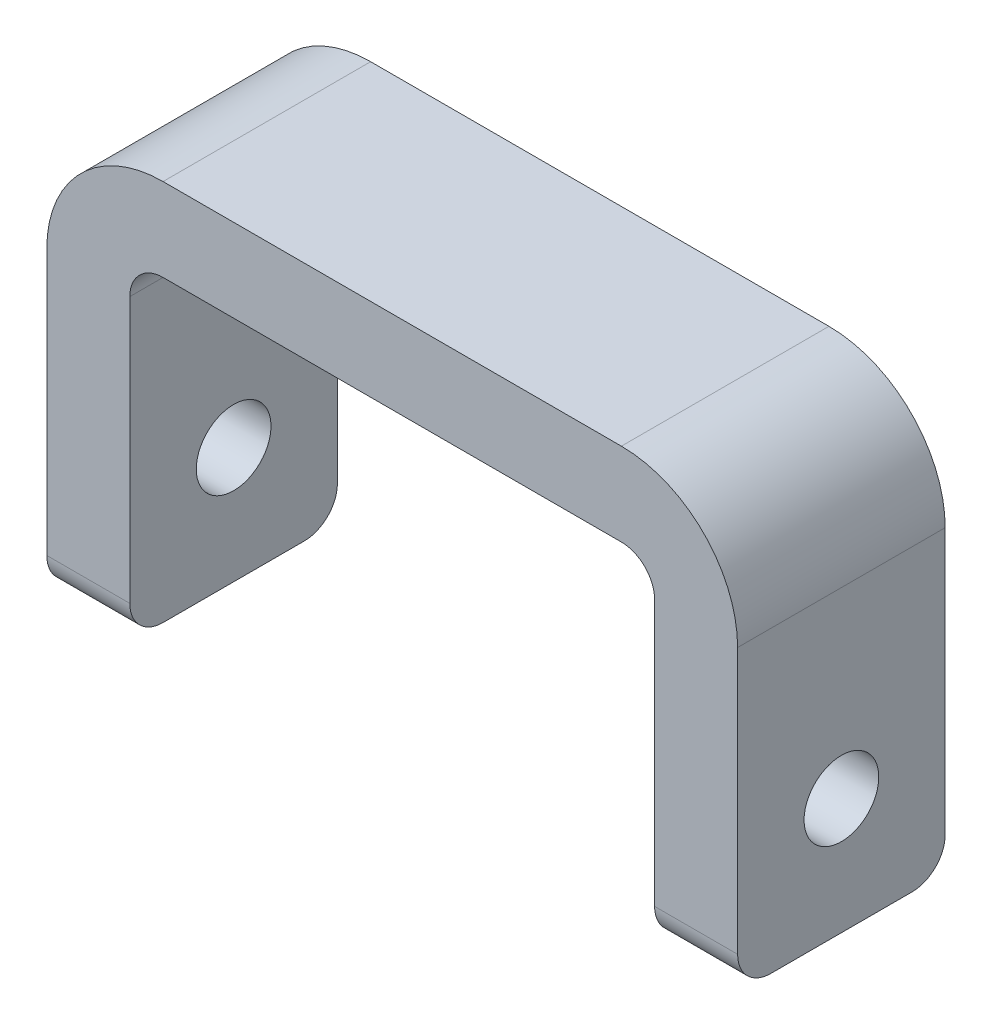
ISO-10303-21;
HEADER;
FILE_DESCRIPTION(('STEP AP214'),'2;1');
FILE_NAME('part.step','',(''),(''),'','','');
FILE_SCHEMA(('AUTOMOTIVE_DESIGN { 1 0 10303 214 1 1 1 1 }'));
ENDSEC;
DATA;
#1=APPLICATION_CONTEXT('core data for automotive mechanical design processes');
#2=APPLICATION_PROTOCOL_DEFINITION('international standard','automotive_design',2000,#1);
#3=PRODUCT_CONTEXT('',#1,'mechanical');
#4=PRODUCT('Part','Part','',(#3));
#5=PRODUCT_RELATED_PRODUCT_CATEGORY('part','',(#4));
#6=PRODUCT_DEFINITION_FORMATION('','',#4);
#7=PRODUCT_DEFINITION_CONTEXT('part definition',#1,'design');
#8=PRODUCT_DEFINITION('design','',#6,#7);
#9=PRODUCT_DEFINITION_SHAPE('','',#8);
#10=(LENGTH_UNIT() NAMED_UNIT(*) SI_UNIT(.MILLI.,.METRE.));
#11=(NAMED_UNIT(*) PLANE_ANGLE_UNIT() SI_UNIT($,.RADIAN.));
#12=(NAMED_UNIT(*) SI_UNIT($,.STERADIAN.) SOLID_ANGLE_UNIT());
#13=UNCERTAINTY_MEASURE_WITH_UNIT(LENGTH_MEASURE(1.E-05),#10,'distance_accuracy_value','');
#14=(GEOMETRIC_REPRESENTATION_CONTEXT(3) GLOBAL_UNCERTAINTY_ASSIGNED_CONTEXT((#13)) GLOBAL_UNIT_ASSIGNED_CONTEXT((#10,
#11,#12)) REPRESENTATION_CONTEXT('',''));
#15=CARTESIAN_POINT('',(0.,0.,0.));
#16=DIRECTION('',(0.,0.,1.));
#17=DIRECTION('',(1.,0.,0.));
#18=AXIS2_PLACEMENT_3D('',#15,#16,#17);
#19=CARTESIAN_POINT('',(-20.8,0.,6.25));
#20=DIRECTION('',(1.,0.,0.));
#21=DIRECTION('',(0.,0.,-1.));
#22=AXIS2_PLACEMENT_3D('',#19,#20,#21);
#23=PLANE('',#22);
#24=DIRECTION('',(0.,-1.,0.));
#25=VECTOR('',#24,1.);
#26=CARTESIAN_POINT('',(-20.8,0.,-6.25));
#27=LINE('',#26,#25);
#28=CARTESIAN_POINT('',(-20.8,18.,-6.25));
#29=VERTEX_POINT('',#28);
#30=CARTESIAN_POINT('',(-20.8,2.,-6.25));
#31=VERTEX_POINT('',#30);
#32=EDGE_CURVE('E206',#29,#31,#27,.T.);
#33=ORIENTED_EDGE('',*,*,#32,.T.);
#34=CARTESIAN_POINT('',(-20.8,2.,-4.25));
#35=DIRECTION('',(1.,0.,0.));
#36=DIRECTION('',(0.,0.,-1.));
#37=AXIS2_PLACEMENT_3D('',#34,#35,#36);
#38=CIRCLE('',#37,2.);
#39=CARTESIAN_POINT('',(-20.8,0.,-4.25));
#40=VERTEX_POINT('',#39);
#41=EDGE_CURVE('E11',#31,#40,#38,.F.);
#42=ORIENTED_EDGE('',*,*,#41,.T.);
#43=DIRECTION('',(0.,0.,-1.));
#44=VECTOR('',#43,1.);
#45=CARTESIAN_POINT('',(-20.8,0.,6.25));
#46=LINE('',#45,#44);
#47=CARTESIAN_POINT('',(-20.8,0.,4.25));
#48=VERTEX_POINT('',#47);
#49=EDGE_CURVE('E214',#48,#40,#46,.T.);
#50=ORIENTED_EDGE('',*,*,#49,.F.);
#51=CARTESIAN_POINT('',(-20.8,2.,4.25));
#52=DIRECTION('',(1.,0.,0.));
#53=DIRECTION('',(0.,0.,-1.));
#54=AXIS2_PLACEMENT_3D('',#51,#52,#53);
#55=CIRCLE('',#54,2.);
#56=CARTESIAN_POINT('',(-20.8,2.,6.25));
#57=VERTEX_POINT('',#56);
#58=EDGE_CURVE('E54',#48,#57,#55,.F.);
#59=ORIENTED_EDGE('',*,*,#58,.T.);
#60=DIRECTION('',(0.,-1.,0.));
#61=VECTOR('',#60,1.);
#62=CARTESIAN_POINT('',(-20.8,0.,6.25));
#63=LINE('',#62,#61);
#64=CARTESIAN_POINT('',(-20.8,18.,6.25));
#65=VERTEX_POINT('',#64);
#66=EDGE_CURVE('E215',#65,#57,#63,.T.);
#67=ORIENTED_EDGE('',*,*,#66,.F.);
#68=DIRECTION('',(0.,0.,-1.));
#69=VECTOR('',#68,1.);
#70=CARTESIAN_POINT('',(-20.8,18.,6.25));
#71=LINE('',#70,#69);
#72=EDGE_CURVE('E265',#65,#29,#71,.T.);
#73=ORIENTED_EDGE('',*,*,#72,.T.);
#74=EDGE_LOOP('',(#33,#42,#50,#59,#67,#73));
#75=FACE_BOUND('',#74,.T.);
#76=CARTESIAN_POINT('',(-20.8,7.,0.));
#77=DIRECTION('',(-1.,0.,0.));
#78=DIRECTION('',(0.,0.,1.));
#79=AXIS2_PLACEMENT_3D('',#76,#77,#78);
#80=CIRCLE('',#79,2.24999999999999);
#81=CARTESIAN_POINT('',(-20.8,7.,2.24999999999999));
#82=VERTEX_POINT('',#81);
#83=EDGE_CURVE('E364',#82,#82,#80,.T.);
#84=ORIENTED_EDGE('',*,*,#83,.F.);
#85=EDGE_LOOP('',(#84));
#86=FACE_BOUND('',#85,.T.);
#87=ADVANCED_FACE('F45',(#75,#86),#23,.F.);
#88=CARTESIAN_POINT('',(-15.8,0.,6.25));
#89=DIRECTION('',(-1.,0.,0.));
#90=DIRECTION('',(0.,0.,1.));
#91=AXIS2_PLACEMENT_3D('',#88,#89,#90);
#92=PLANE('',#91);
#93=CARTESIAN_POINT('',(-15.8,7.,0.));
#94=DIRECTION('',(-1.,0.,0.));
#95=DIRECTION('',(0.,0.,1.));
#96=AXIS2_PLACEMENT_3D('',#93,#94,#95);
#97=CIRCLE('',#96,2.24999999999999);
#98=CARTESIAN_POINT('',(-15.8,7.,2.24999999999999));
#99=VERTEX_POINT('',#98);
#100=EDGE_CURVE('E340',#99,#99,#97,.T.);
#101=ORIENTED_EDGE('',*,*,#100,.T.);
#102=EDGE_LOOP('',(#101));
#103=FACE_BOUND('',#102,.T.);
#104=DIRECTION('',(0.,0.,-1.));
#105=VECTOR('',#104,1.);
#106=CARTESIAN_POINT('',(-15.8,0.,6.25));
#107=LINE('',#106,#105);
#108=CARTESIAN_POINT('',(-15.8,0.,4.25));
#109=VERTEX_POINT('',#108);
#110=CARTESIAN_POINT('',(-15.8,0.,-4.25));
#111=VERTEX_POINT('',#110);
#112=EDGE_CURVE('E210',#109,#111,#107,.T.);
#113=ORIENTED_EDGE('',*,*,#112,.T.);
#114=CARTESIAN_POINT('',(-15.8,2.,-4.25));
#115=DIRECTION('',(-1.,0.,0.));
#116=DIRECTION('',(0.,0.,1.));
#117=AXIS2_PLACEMENT_3D('',#114,#115,#116);
#118=CIRCLE('',#117,2.);
#119=CARTESIAN_POINT('',(-15.8,2.,-6.25));
#120=VERTEX_POINT('',#119);
#121=EDGE_CURVE('E310',#111,#120,#118,.F.);
#122=ORIENTED_EDGE('',*,*,#121,.T.);
#123=DIRECTION('',(0.,1.,0.));
#124=VECTOR('',#123,1.);
#125=CARTESIAN_POINT('',(-15.8,0.,-6.25));
#126=LINE('',#125,#124);
#127=CARTESIAN_POINT('',(-15.8,18.,-6.25));
#128=VERTEX_POINT('',#127);
#129=EDGE_CURVE('E199',#120,#128,#126,.T.);
#130=ORIENTED_EDGE('',*,*,#129,.T.);
#131=DIRECTION('',(0.,0.,-1.));
#132=VECTOR('',#131,1.);
#133=CARTESIAN_POINT('',(-15.8,18.,6.25));
#134=LINE('',#133,#132);
#135=CARTESIAN_POINT('',(-15.8,18.,6.25));
#136=VERTEX_POINT('',#135);
#137=EDGE_CURVE('E171',#128,#136,#134,.F.);
#138=ORIENTED_EDGE('',*,*,#137,.T.);
#139=DIRECTION('',(0.,1.,0.));
#140=VECTOR('',#139,1.);
#141=CARTESIAN_POINT('',(-15.8,0.,6.25));
#142=LINE('',#141,#140);
#143=CARTESIAN_POINT('',(-15.8,2.,6.25));
#144=VERTEX_POINT('',#143);
#145=EDGE_CURVE('E209',#144,#136,#142,.T.);
#146=ORIENTED_EDGE('',*,*,#145,.F.);
#147=CARTESIAN_POINT('',(-15.8,2.,4.25));
#148=DIRECTION('',(-1.,0.,0.));
#149=DIRECTION('',(0.,0.,1.));
#150=AXIS2_PLACEMENT_3D('',#147,#148,#149);
#151=CIRCLE('',#150,2.);
#152=EDGE_CURVE('E307',#144,#109,#151,.F.);
#153=ORIENTED_EDGE('',*,*,#152,.T.);
#154=EDGE_LOOP('',(#113,#122,#130,#138,#146,#153));
#155=FACE_BOUND('',#154,.T.);
#156=ADVANCED_FACE('F330',(#103,#155),#92,.F.);
#157=CARTESIAN_POINT('',(-15.8,20.,6.25));
#158=DIRECTION('',(0.,1.,0.));
#159=DIRECTION('',(0.,0.,1.));
#160=AXIS2_PLACEMENT_3D('',#157,#158,#159);
#161=PLANE('',#160);
#162=DIRECTION('',(1.,0.,0.));
#163=VECTOR('',#162,1.);
#164=CARTESIAN_POINT('',(-15.8,20.,-6.25));
#165=LINE('',#164,#163);
#166=CARTESIAN_POINT('',(-13.8,20.,-6.25));
#167=VERTEX_POINT('',#166);
#168=CARTESIAN_POINT('',(13.8,20.,-6.25));
#169=VERTEX_POINT('',#168);
#170=EDGE_CURVE('E191',#167,#169,#165,.T.);
#171=ORIENTED_EDGE('',*,*,#170,.T.);
#172=DIRECTION('',(0.,0.,-1.));
#173=VECTOR('',#172,1.);
#174=CARTESIAN_POINT('',(13.8,20.,6.25));
#175=LINE('',#174,#173);
#176=CARTESIAN_POINT('',(13.8,20.,6.25));
#177=VERTEX_POINT('',#176);
#178=EDGE_CURVE('E164',#169,#177,#175,.F.);
#179=ORIENTED_EDGE('',*,*,#178,.T.);
#180=DIRECTION('',(1.,0.,0.));
#181=VECTOR('',#180,1.);
#182=CARTESIAN_POINT('',(-15.8,20.,6.25));
#183=LINE('',#182,#181);
#184=CARTESIAN_POINT('',(-13.8,20.,6.25));
#185=VERTEX_POINT('',#184);
#186=EDGE_CURVE('E353',#185,#177,#183,.T.);
#187=ORIENTED_EDGE('',*,*,#186,.F.);
#188=DIRECTION('',(0.,0.,-1.));
#189=VECTOR('',#188,1.);
#190=CARTESIAN_POINT('',(-13.8,20.,-6.25));
#191=LINE('',#190,#189);
#192=EDGE_CURVE('E182',#185,#167,#191,.T.);
#193=ORIENTED_EDGE('',*,*,#192,.T.);
#194=EDGE_LOOP('',(#171,#179,#187,#193));
#195=FACE_BOUND('',#194,.T.);
#196=ADVANCED_FACE('F375',(#195),#161,.F.);
#197=CARTESIAN_POINT('',(15.8,0.,6.25));
#198=DIRECTION('',(1.,0.,0.));
#199=DIRECTION('',(0.,0.,-1.));
#200=AXIS2_PLACEMENT_3D('',#197,#198,#199);
#201=PLANE('',#200);
#202=CARTESIAN_POINT('',(15.8,7.,0.));
#203=DIRECTION('',(1.,0.,0.));
#204=DIRECTION('',(0.,0.,-1.));
#205=AXIS2_PLACEMENT_3D('',#202,#203,#204);
#206=CIRCLE('',#205,2.24999999999999);
#207=CARTESIAN_POINT('',(15.8,7.,-2.24999999999999));
#208=VERTEX_POINT('',#207);
#209=EDGE_CURVE('E343',#208,#208,#206,.T.);
#210=ORIENTED_EDGE('',*,*,#209,.T.);
#211=EDGE_LOOP('',(#210));
#212=FACE_BOUND('',#211,.T.);
#213=DIRECTION('',(0.,-1.,0.));
#214=VECTOR('',#213,1.);
#215=CARTESIAN_POINT('',(15.8,0.,-6.25));
#216=LINE('',#215,#214);
#217=CARTESIAN_POINT('',(15.8,18.,-6.25));
#218=VERTEX_POINT('',#217);
#219=CARTESIAN_POINT('',(15.8,2.,-6.25));
#220=VERTEX_POINT('',#219);
#221=EDGE_CURVE('E177',#218,#220,#216,.T.);
#222=ORIENTED_EDGE('',*,*,#221,.T.);
#223=CARTESIAN_POINT('',(15.8,2.,-4.25));
#224=DIRECTION('',(1.,0.,0.));
#225=DIRECTION('',(0.,0.,-1.));
#226=AXIS2_PLACEMENT_3D('',#223,#224,#225);
#227=CIRCLE('',#226,2.);
#228=CARTESIAN_POINT('',(15.8,0.,-4.25));
#229=VERTEX_POINT('',#228);
#230=EDGE_CURVE('E290',#220,#229,#227,.F.);
#231=ORIENTED_EDGE('',*,*,#230,.T.);
#232=DIRECTION('',(0.,0.,-1.));
#233=VECTOR('',#232,1.);
#234=CARTESIAN_POINT('',(15.8,0.,6.25));
#235=LINE('',#234,#233);
#236=CARTESIAN_POINT('',(15.8,0.,4.25));
#237=VERTEX_POINT('',#236);
#238=EDGE_CURVE('E183',#237,#229,#235,.T.);
#239=ORIENTED_EDGE('',*,*,#238,.F.);
#240=CARTESIAN_POINT('',(15.8,2.,4.25));
#241=DIRECTION('',(1.,0.,0.));
#242=DIRECTION('',(0.,0.,-1.));
#243=AXIS2_PLACEMENT_3D('',#240,#241,#242);
#244=CIRCLE('',#243,2.);
#245=CARTESIAN_POINT('',(15.8,2.,6.25));
#246=VERTEX_POINT('',#245);
#247=EDGE_CURVE('E287',#237,#246,#244,.F.);
#248=ORIENTED_EDGE('',*,*,#247,.T.);
#249=DIRECTION('',(0.,-1.,0.));
#250=VECTOR('',#249,1.);
#251=CARTESIAN_POINT('',(15.8,0.,6.25));
#252=LINE('',#251,#250);
#253=CARTESIAN_POINT('',(15.8,18.,6.25));
#254=VERTEX_POINT('',#253);
#255=EDGE_CURVE('E180',#254,#246,#252,.T.);
#256=ORIENTED_EDGE('',*,*,#255,.F.);
#257=DIRECTION('',(0.,0.,-1.));
#258=VECTOR('',#257,1.);
#259=CARTESIAN_POINT('',(15.8,18.,-6.25));
#260=LINE('',#259,#258);
#261=EDGE_CURVE('E163',#254,#218,#260,.T.);
#262=ORIENTED_EDGE('',*,*,#261,.T.);
#263=EDGE_LOOP('',(#222,#231,#239,#248,#256,#262));
#264=FACE_BOUND('',#263,.T.);
#265=ADVANCED_FACE('F176',(#212,#264),#201,.F.);
#266=CARTESIAN_POINT('',(15.8,0.,6.25));
#267=DIRECTION('',(0.,1.,0.));
#268=DIRECTION('',(-1.,0.,0.));
#269=AXIS2_PLACEMENT_3D('',#266,#267,#268);
#270=PLANE('',#269);
#271=ORIENTED_EDGE('',*,*,#238,.T.);
#272=DIRECTION('',(1.,0.,0.));
#273=VECTOR('',#272,1.);
#274=CARTESIAN_POINT('',(20.8,0.,-4.25));
#275=LINE('',#274,#273);
#276=CARTESIAN_POINT('',(20.8,0.,-4.25));
#277=VERTEX_POINT('',#276);
#278=EDGE_CURVE('E272',#229,#277,#275,.T.);
#279=ORIENTED_EDGE('',*,*,#278,.T.);
#280=DIRECTION('',(0.,0.,-1.));
#281=VECTOR('',#280,1.);
#282=CARTESIAN_POINT('',(20.8,0.,6.25));
#283=LINE('',#282,#281);
#284=CARTESIAN_POINT('',(20.8,0.,4.25));
#285=VERTEX_POINT('',#284);
#286=EDGE_CURVE('E218',#285,#277,#283,.T.);
#287=ORIENTED_EDGE('',*,*,#286,.F.);
#288=DIRECTION('',(1.,0.,0.));
#289=VECTOR('',#288,1.);
#290=CARTESIAN_POINT('',(15.8,0.,4.25));
#291=LINE('',#290,#289);
#292=EDGE_CURVE('E269',#285,#237,#291,.F.);
#293=ORIENTED_EDGE('',*,*,#292,.T.);
#294=EDGE_LOOP('',(#271,#279,#287,#293));
#295=FACE_BOUND('',#294,.T.);
#296=ADVANCED_FACE('F388',(#295),#270,.F.);
#297=CARTESIAN_POINT('',(20.8,0.,6.25));
#298=DIRECTION('',(-1.,0.,0.));
#299=DIRECTION('',(0.,0.,1.));
#300=AXIS2_PLACEMENT_3D('',#297,#298,#299);
#301=PLANE('',#300);
#302=CARTESIAN_POINT('',(20.8,7.,0.));
#303=DIRECTION('',(-1.,0.,0.));
#304=DIRECTION('',(0.,0.,1.));
#305=AXIS2_PLACEMENT_3D('',#302,#303,#304);
#306=CIRCLE('',#305,2.24999999999999);
#307=CARTESIAN_POINT('',(20.8,7.,2.24999999999999));
#308=VERTEX_POINT('',#307);
#309=EDGE_CURVE('E360',#308,#308,#306,.T.);
#310=ORIENTED_EDGE('',*,*,#309,.T.);
#311=EDGE_LOOP('',(#310));
#312=FACE_BOUND('',#311,.T.);
#313=ORIENTED_EDGE('',*,*,#286,.T.);
#314=CARTESIAN_POINT('',(20.8,2.,-4.25));
#315=DIRECTION('',(-1.,0.,0.));
#316=DIRECTION('',(0.,0.,1.));
#317=AXIS2_PLACEMENT_3D('',#314,#315,#316);
#318=CIRCLE('',#317,2.);
#319=CARTESIAN_POINT('',(20.8,2.,-6.25));
#320=VERTEX_POINT('',#319);
#321=EDGE_CURVE('E279',#277,#320,#318,.F.);
#322=ORIENTED_EDGE('',*,*,#321,.T.);
#323=DIRECTION('',(0.,1.,0.));
#324=VECTOR('',#323,1.);
#325=CARTESIAN_POINT('',(20.8,0.,-6.25));
#326=LINE('',#325,#324);
#327=CARTESIAN_POINT('',(20.8,18.,-6.25));
#328=VERTEX_POINT('',#327);
#329=EDGE_CURVE('E190',#320,#328,#326,.T.);
#330=ORIENTED_EDGE('',*,*,#329,.T.);
#331=DIRECTION('',(0.,0.,-1.));
#332=VECTOR('',#331,1.);
#333=CARTESIAN_POINT('',(20.8,18.,6.25));
#334=LINE('',#333,#332);
#335=CARTESIAN_POINT('',(20.8,18.,6.25));
#336=VERTEX_POINT('',#335);
#337=EDGE_CURVE('E255',#328,#336,#334,.F.);
#338=ORIENTED_EDGE('',*,*,#337,.T.);
#339=DIRECTION('',(0.,1.,0.));
#340=VECTOR('',#339,1.);
#341=CARTESIAN_POINT('',(20.8,0.,6.25));
#342=LINE('',#341,#340);
#343=CARTESIAN_POINT('',(20.8,2.,6.25));
#344=VERTEX_POINT('',#343);
#345=EDGE_CURVE('E348',#344,#336,#342,.T.);
#346=ORIENTED_EDGE('',*,*,#345,.F.);
#347=CARTESIAN_POINT('',(20.8,2.,4.25));
#348=DIRECTION('',(-1.,0.,0.));
#349=DIRECTION('',(0.,0.,1.));
#350=AXIS2_PLACEMENT_3D('',#347,#348,#349);
#351=CIRCLE('',#350,2.);
#352=EDGE_CURVE('E276',#344,#285,#351,.F.);
#353=ORIENTED_EDGE('',*,*,#352,.T.);
#354=EDGE_LOOP('',(#313,#322,#330,#338,#346,#353));
#355=FACE_BOUND('',#354,.T.);
#356=ADVANCED_FACE('F384',(#312,#355),#301,.F.);
#357=CARTESIAN_POINT('',(-20.8,25.,6.25));
#358=DIRECTION('',(0.,-1.,0.));
#359=DIRECTION('',(0.,0.,-1.));
#360=AXIS2_PLACEMENT_3D('',#357,#358,#359);
#361=PLANE('',#360);
#362=DIRECTION('',(-1.,0.,0.));
#363=VECTOR('',#362,1.);
#364=CARTESIAN_POINT('',(-20.8,25.,6.25));
#365=LINE('',#364,#363);
#366=CARTESIAN_POINT('',(13.8,25.,6.25));
#367=VERTEX_POINT('',#366);
#368=CARTESIAN_POINT('',(-13.8,25.,6.25));
#369=VERTEX_POINT('',#368);
#370=EDGE_CURVE('E327',#367,#369,#365,.T.);
#371=ORIENTED_EDGE('',*,*,#370,.F.);
#372=DIRECTION('',(0.,0.,-1.));
#373=VECTOR('',#372,1.);
#374=CARTESIAN_POINT('',(13.8,25.,6.25));
#375=LINE('',#374,#373);
#376=CARTESIAN_POINT('',(13.8,25.,-6.25));
#377=VERTEX_POINT('',#376);
#378=EDGE_CURVE('E244',#367,#377,#375,.T.);
#379=ORIENTED_EDGE('',*,*,#378,.T.);
#380=DIRECTION('',(-1.,0.,0.));
#381=VECTOR('',#380,1.);
#382=CARTESIAN_POINT('',(-20.8,25.,-6.25));
#383=LINE('',#382,#381);
#384=CARTESIAN_POINT('',(-13.8,25.,-6.25));
#385=VERTEX_POINT('',#384);
#386=EDGE_CURVE('E196',#377,#385,#383,.T.);
#387=ORIENTED_EDGE('',*,*,#386,.T.);
#388=DIRECTION('',(0.,0.,-1.));
#389=VECTOR('',#388,1.);
#390=CARTESIAN_POINT('',(-13.8,25.,6.25));
#391=LINE('',#390,#389);
#392=EDGE_CURVE('E242',#385,#369,#391,.F.);
#393=ORIENTED_EDGE('',*,*,#392,.T.);
#394=EDGE_LOOP('',(#371,#379,#387,#393));
#395=FACE_BOUND('',#394,.T.);
#396=ADVANCED_FACE('F381',(#395),#361,.F.);
#397=CARTESIAN_POINT('',(-15.8,0.,6.25));
#398=DIRECTION('',(0.,1.,0.));
#399=DIRECTION('',(-1.,0.,0.));
#400=AXIS2_PLACEMENT_3D('',#397,#398,#399);
#401=PLANE('',#400);
#402=ORIENTED_EDGE('',*,*,#49,.T.);
#403=DIRECTION('',(1.,0.,0.));
#404=VECTOR('',#403,1.);
#405=CARTESIAN_POINT('',(-15.8,0.,-4.25));
#406=LINE('',#405,#404);
#407=EDGE_CURVE('E303',#40,#111,#406,.T.);
#408=ORIENTED_EDGE('',*,*,#407,.T.);
#409=ORIENTED_EDGE('',*,*,#112,.F.);
#410=DIRECTION('',(1.,0.,0.));
#411=VECTOR('',#410,1.);
#412=CARTESIAN_POINT('',(-15.8,0.,4.25));
#413=LINE('',#412,#411);
#414=EDGE_CURVE('E66',#109,#48,#413,.F.);
#415=ORIENTED_EDGE('',*,*,#414,.T.);
#416=EDGE_LOOP('',(#402,#408,#409,#415));
#417=FACE_BOUND('',#416,.T.);
#418=ADVANCED_FACE('F331',(#417),#401,.F.);
#419=CARTESIAN_POINT('',(0.,0.,6.25));
#420=DIRECTION('',(0.,0.,-1.));
#421=DIRECTION('',(-1.,0.,0.));
#422=AXIS2_PLACEMENT_3D('',#419,#420,#421);
#423=PLANE('',#422);
#424=ORIENTED_EDGE('',*,*,#255,.T.);
#425=DIRECTION('',(1.,0.,0.));
#426=VECTOR('',#425,1.);
#427=CARTESIAN_POINT('',(0.,2.,6.25));
#428=LINE('',#427,#426);
#429=EDGE_CURVE('E297',#246,#344,#428,.T.);
#430=ORIENTED_EDGE('',*,*,#429,.T.);
#431=ORIENTED_EDGE('',*,*,#345,.T.);
#432=CARTESIAN_POINT('',(13.8,18.,6.25));
#433=DIRECTION('',(0.,0.,-1.));
#434=DIRECTION('',(-1.,0.,0.));
#435=AXIS2_PLACEMENT_3D('',#432,#433,#434);
#436=CIRCLE('',#435,7.);
#437=EDGE_CURVE('E262',#336,#367,#436,.F.);
#438=ORIENTED_EDGE('',*,*,#437,.T.);
#439=ORIENTED_EDGE('',*,*,#370,.T.);
#440=CARTESIAN_POINT('',(-13.8,18.,6.25));
#441=DIRECTION('',(0.,0.,-1.));
#442=DIRECTION('',(-1.,0.,0.));
#443=AXIS2_PLACEMENT_3D('',#440,#441,#442);
#444=CIRCLE('',#443,7.);
#445=EDGE_CURVE('E259',#369,#65,#444,.F.);
#446=ORIENTED_EDGE('',*,*,#445,.T.);
#447=ORIENTED_EDGE('',*,*,#66,.T.);
#448=DIRECTION('',(1.,0.,0.));
#449=VECTOR('',#448,1.);
#450=CARTESIAN_POINT('',(0.,2.,6.25));
#451=LINE('',#450,#449);
#452=EDGE_CURVE('E293',#57,#144,#451,.T.);
#453=ORIENTED_EDGE('',*,*,#452,.T.);
#454=ORIENTED_EDGE('',*,*,#145,.T.);
#455=CARTESIAN_POINT('',(-13.8,18.,6.25));
#456=DIRECTION('',(0.,0.,-1.));
#457=DIRECTION('',(-1.,0.,0.));
#458=AXIS2_PLACEMENT_3D('',#455,#456,#457);
#459=CIRCLE('',#458,2.);
#460=EDGE_CURVE('E239',#136,#185,#459,.T.);
#461=ORIENTED_EDGE('',*,*,#460,.T.);
#462=ORIENTED_EDGE('',*,*,#186,.T.);
#463=CARTESIAN_POINT('',(13.8,18.,6.25));
#464=DIRECTION('',(0.,0.,-1.));
#465=DIRECTION('',(-1.,0.,0.));
#466=AXIS2_PLACEMENT_3D('',#463,#464,#465);
#467=CIRCLE('',#466,2.);
#468=EDGE_CURVE('E170',#177,#254,#467,.T.);
#469=ORIENTED_EDGE('',*,*,#468,.T.);
#470=EDGE_LOOP('',(#424,#430,#431,#438,#439,#446,#447,#453,#454,#461,#462,#469));
#471=FACE_BOUND('',#470,.T.);
#472=ADVANCED_FACE('F322',(#471),#423,.F.);
#473=CARTESIAN_POINT('',(0.,0.,-6.25));
#474=DIRECTION('',(0.,0.,-1.));
#475=DIRECTION('',(-1.,0.,0.));
#476=AXIS2_PLACEMENT_3D('',#473,#474,#475);
#477=PLANE('',#476);
#478=ORIENTED_EDGE('',*,*,#329,.F.);
#479=DIRECTION('',(1.,0.,0.));
#480=VECTOR('',#479,1.);
#481=CARTESIAN_POINT('',(15.8,2.,-6.25));
#482=LINE('',#481,#480);
#483=EDGE_CURVE('E188',#320,#220,#482,.F.);
#484=ORIENTED_EDGE('',*,*,#483,.T.);
#485=ORIENTED_EDGE('',*,*,#221,.F.);
#486=CARTESIAN_POINT('',(13.8,18.,-6.25));
#487=DIRECTION('',(0.,0.,-1.));
#488=DIRECTION('',(-1.,0.,0.));
#489=AXIS2_PLACEMENT_3D('',#486,#487,#488);
#490=CIRCLE('',#489,2.);
#491=EDGE_CURVE('E159',#218,#169,#490,.F.);
#492=ORIENTED_EDGE('',*,*,#491,.T.);
#493=ORIENTED_EDGE('',*,*,#170,.F.);
#494=CARTESIAN_POINT('',(-13.8,18.,-6.25));
#495=DIRECTION('',(0.,0.,-1.));
#496=DIRECTION('',(-1.,0.,0.));
#497=AXIS2_PLACEMENT_3D('',#494,#495,#496);
#498=CIRCLE('',#497,2.);
#499=EDGE_CURVE('E235',#167,#128,#498,.F.);
#500=ORIENTED_EDGE('',*,*,#499,.T.);
#501=ORIENTED_EDGE('',*,*,#129,.F.);
#502=DIRECTION('',(1.,0.,0.));
#503=VECTOR('',#502,1.);
#504=CARTESIAN_POINT('',(-20.8,2.,-6.25));
#505=LINE('',#504,#503);
#506=EDGE_CURVE('E282',#120,#31,#505,.F.);
#507=ORIENTED_EDGE('',*,*,#506,.T.);
#508=ORIENTED_EDGE('',*,*,#32,.F.);
#509=CARTESIAN_POINT('',(-13.8,18.,-6.25));
#510=DIRECTION('',(0.,0.,-1.));
#511=DIRECTION('',(-1.,0.,0.));
#512=AXIS2_PLACEMENT_3D('',#509,#510,#511);
#513=CIRCLE('',#512,7.);
#514=EDGE_CURVE('E248',#29,#385,#513,.T.);
#515=ORIENTED_EDGE('',*,*,#514,.T.);
#516=ORIENTED_EDGE('',*,*,#386,.F.);
#517=CARTESIAN_POINT('',(13.8,18.,-6.25));
#518=DIRECTION('',(0.,0.,-1.));
#519=DIRECTION('',(-1.,0.,0.));
#520=AXIS2_PLACEMENT_3D('',#517,#518,#519);
#521=CIRCLE('',#520,7.);
#522=EDGE_CURVE('E251',#377,#328,#521,.T.);
#523=ORIENTED_EDGE('',*,*,#522,.T.);
#524=EDGE_LOOP('',(#478,#484,#485,#492,#493,#500,#501,#507,#508,#515,#516,#523));
#525=FACE_BOUND('',#524,.T.);
#526=ADVANCED_FACE('F186',(#525),#477,.T.);
#527=CARTESIAN_POINT('',(13.8,18.,6.25));
#528=DIRECTION('',(0.,0.,1.));
#529=DIRECTION('',(1.,0.,0.));
#530=AXIS2_PLACEMENT_3D('',#527,#528,#529);
#531=CYLINDRICAL_SURFACE('',#530,2.);
#532=ORIENTED_EDGE('',*,*,#468,.F.);
#533=ORIENTED_EDGE('',*,*,#178,.F.);
#534=ORIENTED_EDGE('',*,*,#491,.F.);
#535=ORIENTED_EDGE('',*,*,#261,.F.);
#536=EDGE_LOOP('',(#532,#533,#534,#535));
#537=FACE_BOUND('',#536,.T.);
#538=ADVANCED_FACE('F162',(#537),#531,.F.);
#539=CARTESIAN_POINT('',(-13.8,18.,6.25));
#540=DIRECTION('',(0.,0.,1.));
#541=DIRECTION('',(1.,0.,0.));
#542=AXIS2_PLACEMENT_3D('',#539,#540,#541);
#543=CYLINDRICAL_SURFACE('',#542,2.);
#544=ORIENTED_EDGE('',*,*,#460,.F.);
#545=ORIENTED_EDGE('',*,*,#137,.F.);
#546=ORIENTED_EDGE('',*,*,#499,.F.);
#547=ORIENTED_EDGE('',*,*,#192,.F.);
#548=EDGE_LOOP('',(#544,#545,#546,#547));
#549=FACE_BOUND('',#548,.T.);
#550=ADVANCED_FACE('F401',(#549),#543,.F.);
#551=CARTESIAN_POINT('',(13.8,18.,6.25));
#552=DIRECTION('',(0.,0.,-1.));
#553=DIRECTION('',(-1.,0.,0.));
#554=AXIS2_PLACEMENT_3D('',#551,#552,#553);
#555=CYLINDRICAL_SURFACE('',#554,7.);
#556=ORIENTED_EDGE('',*,*,#437,.F.);
#557=ORIENTED_EDGE('',*,*,#337,.F.);
#558=ORIENTED_EDGE('',*,*,#522,.F.);
#559=ORIENTED_EDGE('',*,*,#378,.F.);
#560=EDGE_LOOP('',(#556,#557,#558,#559));
#561=FACE_BOUND('',#560,.T.);
#562=ADVANCED_FACE('F404',(#561),#555,.T.);
#563=CARTESIAN_POINT('',(-13.8,18.,6.25));
#564=DIRECTION('',(0.,0.,-1.));
#565=DIRECTION('',(-1.,0.,0.));
#566=AXIS2_PLACEMENT_3D('',#563,#564,#565);
#567=CYLINDRICAL_SURFACE('',#566,7.);
#568=ORIENTED_EDGE('',*,*,#445,.F.);
#569=ORIENTED_EDGE('',*,*,#392,.F.);
#570=ORIENTED_EDGE('',*,*,#514,.F.);
#571=ORIENTED_EDGE('',*,*,#72,.F.);
#572=EDGE_LOOP('',(#568,#569,#570,#571));
#573=FACE_BOUND('',#572,.T.);
#574=ADVANCED_FACE('F408',(#573),#567,.T.);
#575=CARTESIAN_POINT('',(15.8,2.,-4.25));
#576=DIRECTION('',(-1.,0.,0.));
#577=DIRECTION('',(0.,-1.,0.));
#578=AXIS2_PLACEMENT_3D('',#575,#576,#577);
#579=CYLINDRICAL_SURFACE('',#578,2.);
#580=ORIENTED_EDGE('',*,*,#230,.F.);
#581=ORIENTED_EDGE('',*,*,#483,.F.);
#582=ORIENTED_EDGE('',*,*,#321,.F.);
#583=ORIENTED_EDGE('',*,*,#278,.F.);
#584=EDGE_LOOP('',(#580,#581,#582,#583));
#585=FACE_BOUND('',#584,.T.);
#586=ADVANCED_FACE('F412',(#585),#579,.T.);
#587=CARTESIAN_POINT('',(0.,2.,4.25));
#588=DIRECTION('',(1.,0.,0.));
#589=DIRECTION('',(0.,1.,0.));
#590=AXIS2_PLACEMENT_3D('',#587,#588,#589);
#591=CYLINDRICAL_SURFACE('',#590,2.);
#592=ORIENTED_EDGE('',*,*,#247,.F.);
#593=ORIENTED_EDGE('',*,*,#292,.F.);
#594=ORIENTED_EDGE('',*,*,#352,.F.);
#595=ORIENTED_EDGE('',*,*,#429,.F.);
#596=EDGE_LOOP('',(#592,#593,#594,#595));
#597=FACE_BOUND('',#596,.T.);
#598=ADVANCED_FACE('F416',(#597),#591,.T.);
#599=CARTESIAN_POINT('',(-15.8,2.,-4.25));
#600=DIRECTION('',(-1.,0.,0.));
#601=DIRECTION('',(0.,-1.,0.));
#602=AXIS2_PLACEMENT_3D('',#599,#600,#601);
#603=CYLINDRICAL_SURFACE('',#602,2.);
#604=ORIENTED_EDGE('',*,*,#41,.F.);
#605=ORIENTED_EDGE('',*,*,#506,.F.);
#606=ORIENTED_EDGE('',*,*,#121,.F.);
#607=ORIENTED_EDGE('',*,*,#407,.F.);
#608=EDGE_LOOP('',(#604,#605,#606,#607));
#609=FACE_BOUND('',#608,.T.);
#610=ADVANCED_FACE('F334',(#609),#603,.T.);
#611=CARTESIAN_POINT('',(0.,2.,4.25));
#612=DIRECTION('',(1.,0.,0.));
#613=DIRECTION('',(0.,1.,0.));
#614=AXIS2_PLACEMENT_3D('',#611,#612,#613);
#615=CYLINDRICAL_SURFACE('',#614,2.);
#616=ORIENTED_EDGE('',*,*,#58,.F.);
#617=ORIENTED_EDGE('',*,*,#414,.F.);
#618=ORIENTED_EDGE('',*,*,#152,.F.);
#619=ORIENTED_EDGE('',*,*,#452,.F.);
#620=EDGE_LOOP('',(#616,#617,#618,#619));
#621=FACE_BOUND('',#620,.T.);
#622=ADVANCED_FACE('F47',(#621),#615,.T.);
#623=CARTESIAN_POINT('',(-20.8,7.,0.));
#624=DIRECTION('',(-1.,0.,0.));
#625=DIRECTION('',(0.,0.,1.));
#626=AXIS2_PLACEMENT_3D('',#623,#624,#625);
#627=CYLINDRICAL_SURFACE('',#626,2.24999999999999);
#628=ORIENTED_EDGE('',*,*,#309,.F.);
#629=EDGE_LOOP('',(#628));
#630=FACE_BOUND('',#629,.T.);
#631=ORIENTED_EDGE('',*,*,#209,.F.);
#632=EDGE_LOOP('',(#631));
#633=FACE_BOUND('',#632,.T.);
#634=ADVANCED_FACE('F423',(#630,#633),#627,.F.);
#635=ORIENTED_EDGE('',*,*,#83,.T.);
#636=EDGE_LOOP('',(#635));
#637=FACE_BOUND('',#636,.T.);
#638=ORIENTED_EDGE('',*,*,#100,.F.);
#639=EDGE_LOOP('',(#638));
#640=FACE_BOUND('',#639,.T.);
#641=ADVANCED_FACE('F369',(#637,#640),#627,.F.);
#642=CLOSED_SHELL('',(#87,#156,#196,#265,#296,#356,#396,#418,#472,#526,#538,#550,#562,#574,#586,
#598,#610,#622,#634,#641));
#643=MANIFOLD_SOLID_BREP('B2',#642);
#644=ADVANCED_BREP_SHAPE_REPRESENTATION('',(#18,#643),#14);
#645=SHAPE_DEFINITION_REPRESENTATION(#9,#644);
ENDSEC;
END-ISO-10303-21;
